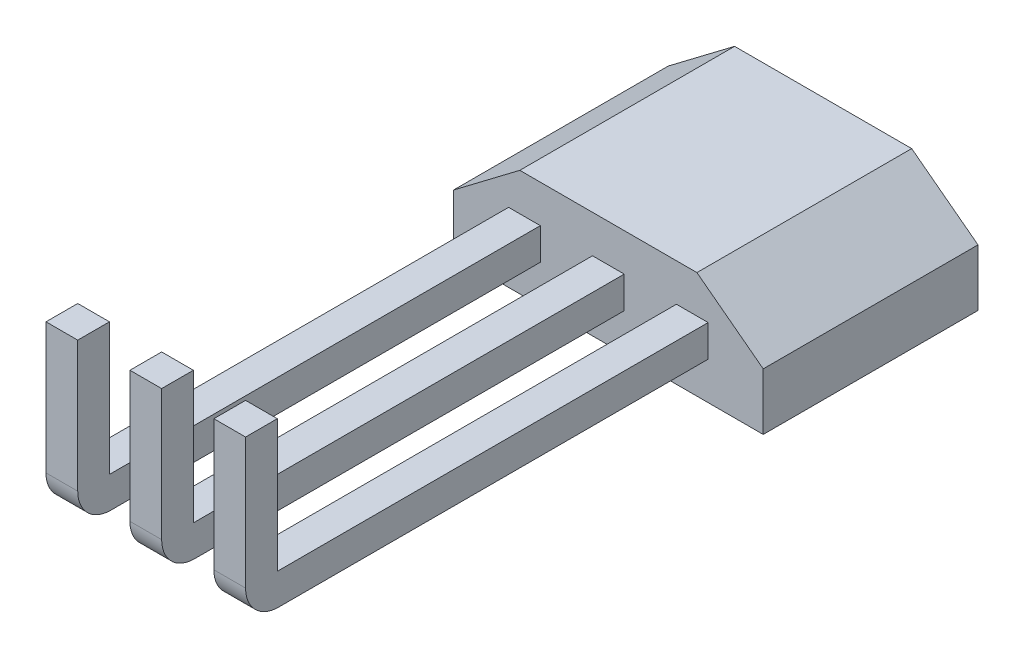
ISO-10303-21;
HEADER;
FILE_DESCRIPTION(('STEP AP214'),'2;1');
FILE_NAME('part.step','',(''),(''),'','','');
FILE_SCHEMA(('AUTOMOTIVE_DESIGN { 1 0 10303 214 1 1 1 1 }'));
ENDSEC;
DATA;
#1=APPLICATION_CONTEXT('core data for automotive mechanical design processes');
#2=APPLICATION_PROTOCOL_DEFINITION('international standard','automotive_design',2000,#1);
#3=PRODUCT_CONTEXT('',#1,'mechanical');
#4=PRODUCT('Part','Part','',(#3));
#5=PRODUCT_RELATED_PRODUCT_CATEGORY('part','',(#4));
#6=PRODUCT_DEFINITION_FORMATION('','',#4);
#7=PRODUCT_DEFINITION_CONTEXT('part definition',#1,'design');
#8=PRODUCT_DEFINITION('design','',#6,#7);
#9=PRODUCT_DEFINITION_SHAPE('','',#8);
#10=(LENGTH_UNIT() NAMED_UNIT(*) SI_UNIT(.MILLI.,.METRE.));
#11=(NAMED_UNIT(*) PLANE_ANGLE_UNIT() SI_UNIT($,.RADIAN.));
#12=(NAMED_UNIT(*) SI_UNIT($,.STERADIAN.) SOLID_ANGLE_UNIT());
#13=UNCERTAINTY_MEASURE_WITH_UNIT(LENGTH_MEASURE(1.E-05),#10,'distance_accuracy_value','');
#14=(GEOMETRIC_REPRESENTATION_CONTEXT(3) GLOBAL_UNCERTAINTY_ASSIGNED_CONTEXT((#13)) GLOBAL_UNIT_ASSIGNED_CONTEXT((#10,
#11,#12)) REPRESENTATION_CONTEXT('',''));
#15=CARTESIAN_POINT('',(0.,0.,0.));
#16=DIRECTION('',(0.,0.,1.));
#17=DIRECTION('',(1.,0.,0.));
#18=AXIS2_PLACEMENT_3D('',#15,#16,#17);
#19=CARTESIAN_POINT('',(1.03,1.05,10.25));
#20=DIRECTION('',(0.,-1.,0.));
#21=DIRECTION('',(0.,0.,-1.));
#22=AXIS2_PLACEMENT_3D('',#19,#20,#21);
#23=PLANE('',#22);
#24=DIRECTION('',(-1.,0.,0.));
#25=VECTOR('',#24,1.);
#26=CARTESIAN_POINT('',(1.03,1.05,9.77));
#27=LINE('',#26,#25);
#28=CARTESIAN_POINT('',(1.51,1.05,9.77));
#29=VERTEX_POINT('',#28);
#30=CARTESIAN_POINT('',(1.03,1.05,9.77));
#31=VERTEX_POINT('',#30);
#32=EDGE_CURVE('E247',#29,#31,#27,.T.);
#33=ORIENTED_EDGE('',*,*,#32,.F.);
#34=DIRECTION('',(0.,0.,-1.));
#35=VECTOR('',#34,1.);
#36=CARTESIAN_POINT('',(1.51,1.05,10.25));
#37=LINE('',#36,#35);
#38=CARTESIAN_POINT('',(1.51,1.05,3.25));
#39=VERTEX_POINT('',#38);
#40=EDGE_CURVE('E371',#29,#39,#37,.T.);
#41=ORIENTED_EDGE('',*,*,#40,.T.);
#42=DIRECTION('',(-1.,0.,0.));
#43=VECTOR('',#42,1.);
#44=CARTESIAN_POINT('',(1.03,1.05,3.25));
#45=LINE('',#44,#43);
#46=CARTESIAN_POINT('',(1.03,1.05,3.25));
#47=VERTEX_POINT('',#46);
#48=EDGE_CURVE('E352',#39,#47,#45,.T.);
#49=ORIENTED_EDGE('',*,*,#48,.T.);
#50=DIRECTION('',(0.,0.,-1.));
#51=VECTOR('',#50,1.);
#52=CARTESIAN_POINT('',(1.03,1.05,10.25));
#53=LINE('',#52,#51);
#54=EDGE_CURVE('E368',#31,#47,#53,.T.);
#55=ORIENTED_EDGE('',*,*,#54,.F.);
#56=EDGE_LOOP('',(#33,#41,#49,#55));
#57=FACE_BOUND('',#56,.T.);
#58=ADVANCED_FACE('F39',(#57),#23,.F.);
#59=CARTESIAN_POINT('',(-0.24,1.05,10.25));
#60=DIRECTION('',(0.,-1.,0.));
#61=DIRECTION('',(0.,0.,-1.));
#62=AXIS2_PLACEMENT_3D('',#59,#60,#61);
#63=PLANE('',#62);
#64=DIRECTION('',(-1.,0.,0.));
#65=VECTOR('',#64,1.);
#66=CARTESIAN_POINT('',(-0.24,1.05,9.77));
#67=LINE('',#66,#65);
#68=CARTESIAN_POINT('',(0.24,1.05,9.77));
#69=VERTEX_POINT('',#68);
#70=CARTESIAN_POINT('',(-0.24,1.05,9.77));
#71=VERTEX_POINT('',#70);
#72=EDGE_CURVE('E262',#69,#71,#67,.T.);
#73=ORIENTED_EDGE('',*,*,#72,.F.);
#74=DIRECTION('',(0.,0.,-1.));
#75=VECTOR('',#74,1.);
#76=CARTESIAN_POINT('',(0.24,1.05,10.25));
#77=LINE('',#76,#75);
#78=CARTESIAN_POINT('',(0.24,1.05,3.25));
#79=VERTEX_POINT('',#78);
#80=EDGE_CURVE('E406',#69,#79,#77,.T.);
#81=ORIENTED_EDGE('',*,*,#80,.T.);
#82=DIRECTION('',(-1.,0.,0.));
#83=VECTOR('',#82,1.);
#84=CARTESIAN_POINT('',(-0.24,1.05,3.25));
#85=LINE('',#84,#83);
#86=CARTESIAN_POINT('',(-0.24,1.05,3.25));
#87=VERTEX_POINT('',#86);
#88=EDGE_CURVE('E387',#79,#87,#85,.T.);
#89=ORIENTED_EDGE('',*,*,#88,.T.);
#90=DIRECTION('',(0.,0.,-1.));
#91=VECTOR('',#90,1.);
#92=CARTESIAN_POINT('',(-0.24,1.05,10.25));
#93=LINE('',#92,#91);
#94=EDGE_CURVE('E403',#71,#87,#93,.T.);
#95=ORIENTED_EDGE('',*,*,#94,.F.);
#96=EDGE_LOOP('',(#73,#81,#89,#95));
#97=FACE_BOUND('',#96,.T.);
#98=ADVANCED_FACE('F527',(#97),#63,.F.);
#99=CARTESIAN_POINT('',(-1.51,1.05,10.25));
#100=DIRECTION('',(0.,-1.,0.));
#101=DIRECTION('',(0.,0.,-1.));
#102=AXIS2_PLACEMENT_3D('',#99,#100,#101);
#103=PLANE('',#102);
#104=DIRECTION('',(-1.,0.,0.));
#105=VECTOR('',#104,1.);
#106=CARTESIAN_POINT('',(-1.51,1.05,9.77));
#107=LINE('',#106,#105);
#108=CARTESIAN_POINT('',(-1.03,1.05,9.77));
#109=VERTEX_POINT('',#108);
#110=CARTESIAN_POINT('',(-1.51,1.05,9.77));
#111=VERTEX_POINT('',#110);
#112=EDGE_CURVE('E286',#109,#111,#107,.T.);
#113=ORIENTED_EDGE('',*,*,#112,.F.);
#114=DIRECTION('',(0.,0.,-1.));
#115=VECTOR('',#114,1.);
#116=CARTESIAN_POINT('',(-1.03,1.05,10.25));
#117=LINE('',#116,#115);
#118=CARTESIAN_POINT('',(-1.03,1.05,3.25));
#119=VERTEX_POINT('',#118);
#120=EDGE_CURVE('E342',#109,#119,#117,.T.);
#121=ORIENTED_EDGE('',*,*,#120,.T.);
#122=DIRECTION('',(-1.,0.,0.));
#123=VECTOR('',#122,1.);
#124=CARTESIAN_POINT('',(-1.51,1.05,3.25));
#125=LINE('',#124,#123);
#126=CARTESIAN_POINT('',(-1.51,1.05,3.25));
#127=VERTEX_POINT('',#126);
#128=EDGE_CURVE('E323',#119,#127,#125,.T.);
#129=ORIENTED_EDGE('',*,*,#128,.T.);
#130=DIRECTION('',(0.,0.,-1.));
#131=VECTOR('',#130,1.);
#132=CARTESIAN_POINT('',(-1.51,1.05,10.25));
#133=LINE('',#132,#131);
#134=EDGE_CURVE('E339',#111,#127,#133,.T.);
#135=ORIENTED_EDGE('',*,*,#134,.F.);
#136=EDGE_LOOP('',(#113,#121,#129,#135));
#137=FACE_BOUND('',#136,.T.);
#138=ADVANCED_FACE('F533',(#137),#103,.F.);
#139=CARTESIAN_POINT('',(0.,0.,3.25));
#140=DIRECTION('',(0.,0.,-1.));
#141=DIRECTION('',(-1.,0.,0.));
#142=AXIS2_PLACEMENT_3D('',#139,#140,#141);
#143=PLANE('',#142);
#144=DIRECTION('',(0.,1.,0.));
#145=VECTOR('',#144,1.);
#146=CARTESIAN_POINT('',(1.51,1.05,3.25));
#147=LINE('',#146,#145);
#148=CARTESIAN_POINT('',(1.51,0.57,3.25));
#149=VERTEX_POINT('',#148);
#150=EDGE_CURVE('E345',#149,#39,#147,.T.);
#151=ORIENTED_EDGE('',*,*,#150,.F.);
#152=DIRECTION('',(1.,0.,0.));
#153=VECTOR('',#152,1.);
#154=CARTESIAN_POINT('',(1.03,0.57,3.25));
#155=LINE('',#154,#153);
#156=CARTESIAN_POINT('',(1.03,0.57,3.25));
#157=VERTEX_POINT('',#156);
#158=EDGE_CURVE('E347',#157,#149,#155,.T.);
#159=ORIENTED_EDGE('',*,*,#158,.F.);
#160=DIRECTION('',(0.,-1.,0.));
#161=VECTOR('',#160,1.);
#162=CARTESIAN_POINT('',(1.03,1.05,3.25));
#163=LINE('',#162,#161);
#164=EDGE_CURVE('E356',#47,#157,#163,.T.);
#165=ORIENTED_EDGE('',*,*,#164,.F.);
#166=ORIENTED_EDGE('',*,*,#48,.F.);
#167=EDGE_LOOP('',(#151,#159,#165,#166));
#168=FACE_BOUND('',#167,.T.);
#169=DIRECTION('',(0.,1.,0.));
#170=VECTOR('',#169,1.);
#171=CARTESIAN_POINT('',(2.34341667237482,0.,3.25));
#172=LINE('',#171,#170);
#173=CARTESIAN_POINT('',(2.34341667237482,0.,3.25));
#174=VERTEX_POINT('',#173);
#175=CARTESIAN_POINT('',(2.34341667237482,0.860000000000001,3.25));
#176=VERTEX_POINT('',#175);
#177=EDGE_CURVE('E410',#174,#176,#172,.T.);
#178=ORIENTED_EDGE('',*,*,#177,.T.);
#179=DIRECTION('',(-0.797154911250448,0.603774831762048,0.));
#180=VECTOR('',#179,1.);
#181=CARTESIAN_POINT('',(1.34,1.62,3.25));
#182=LINE('',#181,#180);
#183=CARTESIAN_POINT('',(1.34,1.62,3.25));
#184=VERTEX_POINT('',#183);
#185=EDGE_CURVE('E414',#176,#184,#182,.T.);
#186=ORIENTED_EDGE('',*,*,#185,.T.);
#187=DIRECTION('',(-1.,0.,0.));
#188=VECTOR('',#187,1.);
#189=CARTESIAN_POINT('',(-1.34,1.62,3.25));
#190=LINE('',#189,#188);
#191=CARTESIAN_POINT('',(-1.34,1.62,3.25));
#192=VERTEX_POINT('',#191);
#193=EDGE_CURVE('E418',#184,#192,#190,.T.);
#194=ORIENTED_EDGE('',*,*,#193,.T.);
#195=DIRECTION('',(-0.797154911250448,-0.603774831762049,0.));
#196=VECTOR('',#195,1.);
#197=CARTESIAN_POINT('',(-1.34,1.62,3.25));
#198=LINE('',#197,#196);
#199=CARTESIAN_POINT('',(-2.34341667237482,0.86,3.25));
#200=VERTEX_POINT('',#199);
#201=EDGE_CURVE('E421',#192,#200,#198,.T.);
#202=ORIENTED_EDGE('',*,*,#201,.T.);
#203=DIRECTION('',(0.,-1.,0.));
#204=VECTOR('',#203,1.);
#205=CARTESIAN_POINT('',(-2.34341667237482,0.,3.25));
#206=LINE('',#205,#204);
#207=CARTESIAN_POINT('',(-2.34341667237482,0.,3.25));
#208=VERTEX_POINT('',#207);
#209=EDGE_CURVE('E424',#200,#208,#206,.T.);
#210=ORIENTED_EDGE('',*,*,#209,.T.);
#211=DIRECTION('',(1.,0.,0.));
#212=VECTOR('',#211,1.);
#213=CARTESIAN_POINT('',(-2.34341667237482,0.,3.25));
#214=LINE('',#213,#212);
#215=EDGE_CURVE('E427',#208,#174,#214,.T.);
#216=ORIENTED_EDGE('',*,*,#215,.T.);
#217=EDGE_LOOP('',(#178,#186,#194,#202,#210,#216));
#218=FACE_BOUND('',#217,.T.);
#219=DIRECTION('',(0.,1.,0.));
#220=VECTOR('',#219,1.);
#221=CARTESIAN_POINT('',(0.24,1.05,3.25));
#222=LINE('',#221,#220);
#223=CARTESIAN_POINT('',(0.24,0.57,3.25));
#224=VERTEX_POINT('',#223);
#225=EDGE_CURVE('E374',#224,#79,#222,.T.);
#226=ORIENTED_EDGE('',*,*,#225,.F.);
#227=DIRECTION('',(1.,0.,0.));
#228=VECTOR('',#227,1.);
#229=CARTESIAN_POINT('',(-0.24,0.57,3.25));
#230=LINE('',#229,#228);
#231=CARTESIAN_POINT('',(-0.24,0.57,3.25));
#232=VERTEX_POINT('',#231);
#233=EDGE_CURVE('E379',#232,#224,#230,.T.);
#234=ORIENTED_EDGE('',*,*,#233,.F.);
#235=DIRECTION('',(0.,-1.,0.));
#236=VECTOR('',#235,1.);
#237=CARTESIAN_POINT('',(-0.24,1.05,3.25));
#238=LINE('',#237,#236);
#239=EDGE_CURVE('E391',#87,#232,#238,.T.);
#240=ORIENTED_EDGE('',*,*,#239,.F.);
#241=ORIENTED_EDGE('',*,*,#88,.F.);
#242=EDGE_LOOP('',(#226,#234,#240,#241));
#243=FACE_BOUND('',#242,.T.);
#244=DIRECTION('',(0.,1.,0.));
#245=VECTOR('',#244,1.);
#246=CARTESIAN_POINT('',(-1.03,1.05,3.25));
#247=LINE('',#246,#245);
#248=CARTESIAN_POINT('',(-1.03,0.57,3.25));
#249=VERTEX_POINT('',#248);
#250=EDGE_CURVE('E310',#249,#119,#247,.T.);
#251=ORIENTED_EDGE('',*,*,#250,.F.);
#252=DIRECTION('',(1.,0.,0.));
#253=VECTOR('',#252,1.);
#254=CARTESIAN_POINT('',(-1.51,0.57,3.25));
#255=LINE('',#254,#253);
#256=CARTESIAN_POINT('',(-1.51,0.57,3.25));
#257=VERTEX_POINT('',#256);
#258=EDGE_CURVE('E315',#257,#249,#255,.T.);
#259=ORIENTED_EDGE('',*,*,#258,.F.);
#260=DIRECTION('',(0.,-1.,0.));
#261=VECTOR('',#260,1.);
#262=CARTESIAN_POINT('',(-1.51,1.05,3.25));
#263=LINE('',#262,#261);
#264=EDGE_CURVE('E327',#127,#257,#263,.T.);
#265=ORIENTED_EDGE('',*,*,#264,.F.);
#266=ORIENTED_EDGE('',*,*,#128,.F.);
#267=EDGE_LOOP('',(#251,#259,#265,#266));
#268=FACE_BOUND('',#267,.T.);
#269=ADVANCED_FACE('F561',(#168,#218,#243,#268),#143,.F.);
#270=CARTESIAN_POINT('',(2.34341667237482,0.,3.25));
#271=DIRECTION('',(-1.,0.,0.));
#272=DIRECTION('',(0.,0.,1.));
#273=AXIS2_PLACEMENT_3D('',#270,#271,#272);
#274=PLANE('',#273);
#275=DIRECTION('',(0.,1.,0.));
#276=VECTOR('',#275,1.);
#277=CARTESIAN_POINT('',(2.34341667237482,0.,0.));
#278=LINE('',#277,#276);
#279=CARTESIAN_POINT('',(2.34341667237482,0.,0.));
#280=VERTEX_POINT('',#279);
#281=CARTESIAN_POINT('',(2.34341667237482,0.860000000000001,0.));
#282=VERTEX_POINT('',#281);
#283=EDGE_CURVE('E409',#280,#282,#278,.T.);
#284=ORIENTED_EDGE('',*,*,#283,.T.);
#285=DIRECTION('',(0.,0.,-1.));
#286=VECTOR('',#285,1.);
#287=CARTESIAN_POINT('',(2.34341667237482,0.860000000000001,3.25));
#288=LINE('',#287,#286);
#289=EDGE_CURVE('E467',#176,#282,#288,.T.);
#290=ORIENTED_EDGE('',*,*,#289,.F.);
#291=ORIENTED_EDGE('',*,*,#177,.F.);
#292=DIRECTION('',(0.,0.,-1.));
#293=VECTOR('',#292,1.);
#294=CARTESIAN_POINT('',(2.34341667237482,0.,3.25));
#295=LINE('',#294,#293);
#296=EDGE_CURVE('E430',#174,#280,#295,.T.);
#297=ORIENTED_EDGE('',*,*,#296,.T.);
#298=EDGE_LOOP('',(#284,#290,#291,#297));
#299=FACE_BOUND('',#298,.T.);
#300=ADVANCED_FACE('F564',(#299),#274,.F.);
#301=CARTESIAN_POINT('',(1.34,1.62,3.25));
#302=DIRECTION('',(-0.603774831762048,-0.797154911250448,0.));
#303=DIRECTION('',(0.797154911250449,-0.603774831762048,0.));
#304=AXIS2_PLACEMENT_3D('',#301,#302,#303);
#305=PLANE('',#304);
#306=DIRECTION('',(-0.797154911250448,0.603774831762048,0.));
#307=VECTOR('',#306,1.);
#308=CARTESIAN_POINT('',(1.34,1.62,0.));
#309=LINE('',#308,#307);
#310=CARTESIAN_POINT('',(1.34,1.62,0.));
#311=VERTEX_POINT('',#310);
#312=EDGE_CURVE('E434',#282,#311,#309,.T.);
#313=ORIENTED_EDGE('',*,*,#312,.T.);
#314=DIRECTION('',(0.,0.,-1.));
#315=VECTOR('',#314,1.);
#316=CARTESIAN_POINT('',(1.34,1.62,3.25));
#317=LINE('',#316,#315);
#318=EDGE_CURVE('E463',#184,#311,#317,.T.);
#319=ORIENTED_EDGE('',*,*,#318,.F.);
#320=ORIENTED_EDGE('',*,*,#185,.F.);
#321=ORIENTED_EDGE('',*,*,#289,.T.);
#322=EDGE_LOOP('',(#313,#319,#320,#321));
#323=FACE_BOUND('',#322,.T.);
#324=ADVANCED_FACE('F584',(#323),#305,.F.);
#325=CARTESIAN_POINT('',(-1.34,1.62,3.25));
#326=DIRECTION('',(0.,-1.,0.));
#327=DIRECTION('',(1.,0.,0.));
#328=AXIS2_PLACEMENT_3D('',#325,#326,#327);
#329=PLANE('',#328);
#330=DIRECTION('',(-1.,0.,0.));
#331=VECTOR('',#330,1.);
#332=CARTESIAN_POINT('',(-1.34,1.62,0.));
#333=LINE('',#332,#331);
#334=CARTESIAN_POINT('',(-1.34,1.62,0.));
#335=VERTEX_POINT('',#334);
#336=EDGE_CURVE('E437',#311,#335,#333,.T.);
#337=ORIENTED_EDGE('',*,*,#336,.T.);
#338=DIRECTION('',(0.,0.,-1.));
#339=VECTOR('',#338,1.);
#340=CARTESIAN_POINT('',(-1.34,1.62,3.25));
#341=LINE('',#340,#339);
#342=EDGE_CURVE('E459',#192,#335,#341,.T.);
#343=ORIENTED_EDGE('',*,*,#342,.F.);
#344=ORIENTED_EDGE('',*,*,#193,.F.);
#345=ORIENTED_EDGE('',*,*,#318,.T.);
#346=EDGE_LOOP('',(#337,#343,#344,#345));
#347=FACE_BOUND('',#346,.T.);
#348=ADVANCED_FACE('F580',(#347),#329,.F.);
#349=CARTESIAN_POINT('',(-1.34,1.62,3.25));
#350=DIRECTION('',(0.603774831762049,-0.797154911250448,0.));
#351=DIRECTION('',(0.797154911250448,0.603774831762049,0.));
#352=AXIS2_PLACEMENT_3D('',#349,#350,#351);
#353=PLANE('',#352);
#354=DIRECTION('',(-0.797154911250448,-0.603774831762049,0.));
#355=VECTOR('',#354,1.);
#356=CARTESIAN_POINT('',(-1.34,1.62,0.));
#357=LINE('',#356,#355);
#358=CARTESIAN_POINT('',(-2.34341667237482,0.86,0.));
#359=VERTEX_POINT('',#358);
#360=EDGE_CURVE('E440',#335,#359,#357,.T.);
#361=ORIENTED_EDGE('',*,*,#360,.T.);
#362=DIRECTION('',(0.,0.,-1.));
#363=VECTOR('',#362,1.);
#364=CARTESIAN_POINT('',(-2.34341667237482,0.86,3.25));
#365=LINE('',#364,#363);
#366=EDGE_CURVE('E455',#200,#359,#365,.T.);
#367=ORIENTED_EDGE('',*,*,#366,.F.);
#368=ORIENTED_EDGE('',*,*,#201,.F.);
#369=ORIENTED_EDGE('',*,*,#342,.T.);
#370=EDGE_LOOP('',(#361,#367,#368,#369));
#371=FACE_BOUND('',#370,.T.);
#372=ADVANCED_FACE('F576',(#371),#353,.F.);
#373=CARTESIAN_POINT('',(-2.34341667237482,0.,3.25));
#374=DIRECTION('',(1.,0.,0.));
#375=DIRECTION('',(0.,0.,-1.));
#376=AXIS2_PLACEMENT_3D('',#373,#374,#375);
#377=PLANE('',#376);
#378=DIRECTION('',(0.,-1.,0.));
#379=VECTOR('',#378,1.);
#380=CARTESIAN_POINT('',(-2.34341667237482,0.,0.));
#381=LINE('',#380,#379);
#382=CARTESIAN_POINT('',(-2.34341667237482,0.,0.));
#383=VERTEX_POINT('',#382);
#384=EDGE_CURVE('E443',#359,#383,#381,.T.);
#385=ORIENTED_EDGE('',*,*,#384,.T.);
#386=DIRECTION('',(0.,0.,-1.));
#387=VECTOR('',#386,1.);
#388=CARTESIAN_POINT('',(-2.34341667237482,0.,3.25));
#389=LINE('',#388,#387);
#390=EDGE_CURVE('E451',#208,#383,#389,.T.);
#391=ORIENTED_EDGE('',*,*,#390,.F.);
#392=ORIENTED_EDGE('',*,*,#209,.F.);
#393=ORIENTED_EDGE('',*,*,#366,.T.);
#394=EDGE_LOOP('',(#385,#391,#392,#393));
#395=FACE_BOUND('',#394,.T.);
#396=ADVANCED_FACE('F572',(#395),#377,.F.);
#397=CARTESIAN_POINT('',(-2.34341667237482,0.,3.25));
#398=DIRECTION('',(0.,1.,0.));
#399=DIRECTION('',(0.,0.,1.));
#400=AXIS2_PLACEMENT_3D('',#397,#398,#399);
#401=PLANE('',#400);
#402=DIRECTION('',(1.,0.,0.));
#403=VECTOR('',#402,1.);
#404=CARTESIAN_POINT('',(-2.34341667237482,0.,0.));
#405=LINE('',#404,#403);
#406=EDGE_CURVE('E415',#383,#280,#405,.T.);
#407=ORIENTED_EDGE('',*,*,#406,.T.);
#408=ORIENTED_EDGE('',*,*,#296,.F.);
#409=ORIENTED_EDGE('',*,*,#215,.F.);
#410=ORIENTED_EDGE('',*,*,#390,.T.);
#411=EDGE_LOOP('',(#407,#408,#409,#410));
#412=FACE_BOUND('',#411,.T.);
#413=ADVANCED_FACE('F568',(#412),#401,.F.);
#414=CARTESIAN_POINT('',(0.,0.,0.));
#415=DIRECTION('',(0.,0.,-1.));
#416=DIRECTION('',(-1.,0.,0.));
#417=AXIS2_PLACEMENT_3D('',#414,#415,#416);
#418=PLANE('',#417);
#419=ORIENTED_EDGE('',*,*,#283,.F.);
#420=ORIENTED_EDGE('',*,*,#406,.F.);
#421=ORIENTED_EDGE('',*,*,#384,.F.);
#422=ORIENTED_EDGE('',*,*,#360,.F.);
#423=ORIENTED_EDGE('',*,*,#336,.F.);
#424=ORIENTED_EDGE('',*,*,#312,.F.);
#425=EDGE_LOOP('',(#419,#420,#421,#422,#423,#424));
#426=FACE_BOUND('',#425,.T.);
#427=ADVANCED_FACE('F559',(#426),#418,.T.);
#428=CARTESIAN_POINT('',(0.24,1.05,10.25));
#429=DIRECTION('',(-1.,0.,0.));
#430=DIRECTION('',(0.,-1.,0.));
#431=AXIS2_PLACEMENT_3D('',#428,#429,#430);
#432=PLANE('',#431);
#433=DIRECTION('',(0.,1.,0.));
#434=VECTOR('',#433,1.);
#435=CARTESIAN_POINT('',(0.24,1.05,10.25));
#436=LINE('',#435,#434);
#437=CARTESIAN_POINT('',(0.24,1.07,10.25));
#438=VERTEX_POINT('',#437);
#439=CARTESIAN_POINT('',(0.24,3.05,10.25));
#440=VERTEX_POINT('',#439);
#441=EDGE_CURVE('E375',#438,#440,#436,.T.);
#442=ORIENTED_EDGE('',*,*,#441,.F.);
#443=CARTESIAN_POINT('',(0.24,1.07,9.75));
#444=DIRECTION('',(-1.,0.,0.));
#445=DIRECTION('',(0.,-1.,0.));
#446=AXIS2_PLACEMENT_3D('',#443,#444,#445);
#447=CIRCLE('',#446,0.5);
#448=CARTESIAN_POINT('',(0.24,0.57,9.75));
#449=VERTEX_POINT('',#448);
#450=EDGE_CURVE('E486',#438,#449,#447,.F.);
#451=ORIENTED_EDGE('',*,*,#450,.T.);
#452=DIRECTION('',(0.,0.,-1.));
#453=VECTOR('',#452,1.);
#454=CARTESIAN_POINT('',(0.24,0.57,10.25));
#455=LINE('',#454,#453);
#456=EDGE_CURVE('E383',#449,#224,#455,.T.);
#457=ORIENTED_EDGE('',*,*,#456,.T.);
#458=ORIENTED_EDGE('',*,*,#225,.T.);
#459=ORIENTED_EDGE('',*,*,#80,.F.);
#460=DIRECTION('',(0.,-1.,0.));
#461=VECTOR('',#460,1.);
#462=CARTESIAN_POINT('',(0.24,3.05,9.77));
#463=LINE('',#462,#461);
#464=CARTESIAN_POINT('',(0.24,3.05,9.77));
#465=VERTEX_POINT('',#464);
#466=EDGE_CURVE('E283',#465,#69,#463,.T.);
#467=ORIENTED_EDGE('',*,*,#466,.F.);
#468=DIRECTION('',(0.,0.,-1.));
#469=VECTOR('',#468,1.);
#470=CARTESIAN_POINT('',(0.24,3.05,10.25));
#471=LINE('',#470,#469);
#472=EDGE_CURVE('E271',#440,#465,#471,.T.);
#473=ORIENTED_EDGE('',*,*,#472,.F.);
#474=EDGE_LOOP('',(#442,#451,#457,#458,#459,#467,#473));
#475=FACE_BOUND('',#474,.T.);
#476=ADVANCED_FACE('F554',(#475),#432,.F.);
#477=CARTESIAN_POINT('',(-0.24,1.05,10.25));
#478=DIRECTION('',(1.,0.,0.));
#479=DIRECTION('',(0.,1.,0.));
#480=AXIS2_PLACEMENT_3D('',#477,#478,#479);
#481=PLANE('',#480);
#482=DIRECTION('',(0.,0.,-1.));
#483=VECTOR('',#482,1.);
#484=CARTESIAN_POINT('',(-0.24,0.57,10.25));
#485=LINE('',#484,#483);
#486=CARTESIAN_POINT('',(-0.24,0.57,9.75));
#487=VERTEX_POINT('',#486);
#488=EDGE_CURVE('E400',#487,#232,#485,.T.);
#489=ORIENTED_EDGE('',*,*,#488,.F.);
#490=CARTESIAN_POINT('',(-0.24,1.07,9.75));
#491=DIRECTION('',(1.,0.,0.));
#492=DIRECTION('',(0.,1.,0.));
#493=AXIS2_PLACEMENT_3D('',#490,#491,#492);
#494=CIRCLE('',#493,0.5);
#495=CARTESIAN_POINT('',(-0.24,1.07,10.25));
#496=VERTEX_POINT('',#495);
#497=EDGE_CURVE('E492',#487,#496,#494,.F.);
#498=ORIENTED_EDGE('',*,*,#497,.T.);
#499=DIRECTION('',(0.,-1.,0.));
#500=VECTOR('',#499,1.);
#501=CARTESIAN_POINT('',(-0.24,1.05,10.25));
#502=LINE('',#501,#500);
#503=CARTESIAN_POINT('',(-0.24,3.05,10.25));
#504=VERTEX_POINT('',#503);
#505=EDGE_CURVE('E378',#504,#496,#502,.T.);
#506=ORIENTED_EDGE('',*,*,#505,.F.);
#507=DIRECTION('',(0.,0.,1.));
#508=VECTOR('',#507,1.);
#509=CARTESIAN_POINT('',(-0.24,3.05,10.25));
#510=LINE('',#509,#508);
#511=CARTESIAN_POINT('',(-0.24,3.05,9.77));
#512=VERTEX_POINT('',#511);
#513=EDGE_CURVE('E263',#512,#504,#510,.T.);
#514=ORIENTED_EDGE('',*,*,#513,.F.);
#515=DIRECTION('',(0.,-1.,0.));
#516=VECTOR('',#515,1.);
#517=CARTESIAN_POINT('',(-0.24,3.05,9.77));
#518=LINE('',#517,#516);
#519=EDGE_CURVE('E277',#512,#71,#518,.T.);
#520=ORIENTED_EDGE('',*,*,#519,.T.);
#521=ORIENTED_EDGE('',*,*,#94,.T.);
#522=ORIENTED_EDGE('',*,*,#239,.T.);
#523=EDGE_LOOP('',(#489,#498,#506,#514,#520,#521,#522));
#524=FACE_BOUND('',#523,.T.);
#525=ADVANCED_FACE('F551',(#524),#481,.F.);
#526=CARTESIAN_POINT('',(-0.24,0.57,10.25));
#527=DIRECTION('',(0.,1.,0.));
#528=DIRECTION('',(0.,0.,1.));
#529=AXIS2_PLACEMENT_3D('',#526,#527,#528);
#530=PLANE('',#529);
#531=ORIENTED_EDGE('',*,*,#456,.F.);
#532=DIRECTION('',(1.,0.,0.));
#533=VECTOR('',#532,1.);
#534=CARTESIAN_POINT('',(-0.24,0.57,9.75));
#535=LINE('',#534,#533);
#536=EDGE_CURVE('E489',#449,#487,#535,.F.);
#537=ORIENTED_EDGE('',*,*,#536,.T.);
#538=ORIENTED_EDGE('',*,*,#488,.T.);
#539=ORIENTED_EDGE('',*,*,#233,.T.);
#540=EDGE_LOOP('',(#531,#537,#538,#539));
#541=FACE_BOUND('',#540,.T.);
#542=ADVANCED_FACE('F547',(#541),#530,.F.);
#543=CARTESIAN_POINT('',(0.,0.,10.25));
#544=DIRECTION('',(0.,0.,1.));
#545=DIRECTION('',(1.,0.,0.));
#546=AXIS2_PLACEMENT_3D('',#543,#544,#545);
#547=PLANE('',#546);
#548=ORIENTED_EDGE('',*,*,#505,.T.);
#549=DIRECTION('',(1.,0.,0.));
#550=VECTOR('',#549,1.);
#551=CARTESIAN_POINT('',(0.24,1.07,10.25));
#552=LINE('',#551,#550);
#553=EDGE_CURVE('E482',#496,#438,#552,.T.);
#554=ORIENTED_EDGE('',*,*,#553,.T.);
#555=ORIENTED_EDGE('',*,*,#441,.T.);
#556=DIRECTION('',(1.,0.,0.));
#557=VECTOR('',#556,1.);
#558=CARTESIAN_POINT('',(-0.24,3.05,10.25));
#559=LINE('',#558,#557);
#560=EDGE_CURVE('E267',#504,#440,#559,.T.);
#561=ORIENTED_EDGE('',*,*,#560,.F.);
#562=EDGE_LOOP('',(#548,#554,#555,#561));
#563=FACE_BOUND('',#562,.T.);
#564=ADVANCED_FACE('F543',(#563),#547,.T.);
#565=CARTESIAN_POINT('',(1.51,1.05,10.25));
#566=DIRECTION('',(-1.,0.,0.));
#567=DIRECTION('',(0.,0.,1.));
#568=AXIS2_PLACEMENT_3D('',#565,#566,#567);
#569=PLANE('',#568);
#570=DIRECTION('',(0.,1.,0.));
#571=VECTOR('',#570,1.);
#572=CARTESIAN_POINT('',(1.51,1.05,10.25));
#573=LINE('',#572,#571);
#574=CARTESIAN_POINT('',(1.51,1.07,10.25));
#575=VERTEX_POINT('',#574);
#576=CARTESIAN_POINT('',(1.51,3.05,10.25));
#577=VERTEX_POINT('',#576);
#578=EDGE_CURVE('E231',#575,#577,#573,.T.);
#579=ORIENTED_EDGE('',*,*,#578,.F.);
#580=CARTESIAN_POINT('',(1.51,1.07,9.75));
#581=DIRECTION('',(-1.,0.,0.));
#582=DIRECTION('',(0.,0.,1.));
#583=AXIS2_PLACEMENT_3D('',#580,#581,#582);
#584=CIRCLE('',#583,0.5);
#585=CARTESIAN_POINT('',(1.51,0.57,9.75));
#586=VERTEX_POINT('',#585);
#587=EDGE_CURVE('E474',#575,#586,#584,.F.);
#588=ORIENTED_EDGE('',*,*,#587,.T.);
#589=DIRECTION('',(0.,0.,-1.));
#590=VECTOR('',#589,1.);
#591=CARTESIAN_POINT('',(1.51,0.57,10.25));
#592=LINE('',#591,#590);
#593=EDGE_CURVE('E230',#586,#149,#592,.T.);
#594=ORIENTED_EDGE('',*,*,#593,.T.);
#595=ORIENTED_EDGE('',*,*,#150,.T.);
#596=ORIENTED_EDGE('',*,*,#40,.F.);
#597=DIRECTION('',(0.,-1.,0.));
#598=VECTOR('',#597,1.);
#599=CARTESIAN_POINT('',(1.51,3.05,9.77));
#600=LINE('',#599,#598);
#601=CARTESIAN_POINT('',(1.51,3.05,9.77));
#602=VERTEX_POINT('',#601);
#603=EDGE_CURVE('E259',#602,#29,#600,.T.);
#604=ORIENTED_EDGE('',*,*,#603,.F.);
#605=DIRECTION('',(0.,0.,-1.));
#606=VECTOR('',#605,1.);
#607=CARTESIAN_POINT('',(1.51,3.05,10.25));
#608=LINE('',#607,#606);
#609=EDGE_CURVE('E240',#577,#602,#608,.T.);
#610=ORIENTED_EDGE('',*,*,#609,.F.);
#611=EDGE_LOOP('',(#579,#588,#594,#595,#596,#604,#610));
#612=FACE_BOUND('',#611,.T.);
#613=ADVANCED_FACE('F540',(#612),#569,.F.);
#614=CARTESIAN_POINT('',(1.03,1.05,10.25));
#615=DIRECTION('',(1.,0.,0.));
#616=DIRECTION('',(0.,0.,-1.));
#617=AXIS2_PLACEMENT_3D('',#614,#615,#616);
#618=PLANE('',#617);
#619=DIRECTION('',(0.,0.,-1.));
#620=VECTOR('',#619,1.);
#621=CARTESIAN_POINT('',(1.03,0.57,10.25));
#622=LINE('',#621,#620);
#623=CARTESIAN_POINT('',(1.03,0.57,9.75));
#624=VERTEX_POINT('',#623);
#625=EDGE_CURVE('E365',#624,#157,#622,.T.);
#626=ORIENTED_EDGE('',*,*,#625,.F.);
#627=CARTESIAN_POINT('',(1.03,1.07,9.75));
#628=DIRECTION('',(1.,0.,0.));
#629=DIRECTION('',(0.,0.,-1.));
#630=AXIS2_PLACEMENT_3D('',#627,#628,#629);
#631=CIRCLE('',#630,0.5);
#632=CARTESIAN_POINT('',(1.03,1.07,10.25));
#633=VERTEX_POINT('',#632);
#634=EDGE_CURVE('E225',#624,#633,#631,.F.);
#635=ORIENTED_EDGE('',*,*,#634,.T.);
#636=DIRECTION('',(0.,-1.,0.));
#637=VECTOR('',#636,1.);
#638=CARTESIAN_POINT('',(1.03,1.05,10.25));
#639=LINE('',#638,#637);
#640=CARTESIAN_POINT('',(1.03,3.05,10.25));
#641=VERTEX_POINT('',#640);
#642=EDGE_CURVE('E217',#641,#633,#639,.T.);
#643=ORIENTED_EDGE('',*,*,#642,.F.);
#644=DIRECTION('',(0.,0.,1.));
#645=VECTOR('',#644,1.);
#646=CARTESIAN_POINT('',(1.03,3.05,10.25));
#647=LINE('',#646,#645);
#648=CARTESIAN_POINT('',(1.03,3.05,9.77));
#649=VERTEX_POINT('',#648);
#650=EDGE_CURVE('E223',#649,#641,#647,.T.);
#651=ORIENTED_EDGE('',*,*,#650,.F.);
#652=DIRECTION('',(0.,-1.,0.));
#653=VECTOR('',#652,1.);
#654=CARTESIAN_POINT('',(1.03,3.05,9.77));
#655=LINE('',#654,#653);
#656=EDGE_CURVE('E255',#649,#31,#655,.T.);
#657=ORIENTED_EDGE('',*,*,#656,.T.);
#658=ORIENTED_EDGE('',*,*,#54,.T.);
#659=ORIENTED_EDGE('',*,*,#164,.T.);
#660=EDGE_LOOP('',(#626,#635,#643,#651,#657,#658,#659));
#661=FACE_BOUND('',#660,.T.);
#662=ADVANCED_FACE('F220',(#661),#618,.F.);
#663=CARTESIAN_POINT('',(1.03,0.57,10.25));
#664=DIRECTION('',(0.,1.,0.));
#665=DIRECTION('',(0.,0.,1.));
#666=AXIS2_PLACEMENT_3D('',#663,#664,#665);
#667=PLANE('',#666);
#668=ORIENTED_EDGE('',*,*,#593,.F.);
#669=DIRECTION('',(1.,0.,0.));
#670=VECTOR('',#669,1.);
#671=CARTESIAN_POINT('',(1.03,0.57,9.75));
#672=LINE('',#671,#670);
#673=EDGE_CURVE('E477',#586,#624,#672,.F.);
#674=ORIENTED_EDGE('',*,*,#673,.T.);
#675=ORIENTED_EDGE('',*,*,#625,.T.);
#676=ORIENTED_EDGE('',*,*,#158,.T.);
#677=EDGE_LOOP('',(#668,#674,#675,#676));
#678=FACE_BOUND('',#677,.T.);
#679=ADVANCED_FACE('F611',(#678),#667,.F.);
#680=CARTESIAN_POINT('',(0.,0.,10.25));
#681=DIRECTION('',(0.,0.,1.));
#682=DIRECTION('',(1.,0.,0.));
#683=AXIS2_PLACEMENT_3D('',#680,#681,#682);
#684=PLANE('',#683);
#685=ORIENTED_EDGE('',*,*,#642,.T.);
#686=DIRECTION('',(1.,0.,0.));
#687=VECTOR('',#686,1.);
#688=CARTESIAN_POINT('',(1.51,1.07,10.25));
#689=LINE('',#688,#687);
#690=EDGE_CURVE('E471',#633,#575,#689,.T.);
#691=ORIENTED_EDGE('',*,*,#690,.T.);
#692=ORIENTED_EDGE('',*,*,#578,.T.);
#693=DIRECTION('',(1.,0.,0.));
#694=VECTOR('',#693,1.);
#695=CARTESIAN_POINT('',(1.03,3.05,10.25));
#696=LINE('',#695,#694);
#697=EDGE_CURVE('E234',#641,#577,#696,.T.);
#698=ORIENTED_EDGE('',*,*,#697,.F.);
#699=EDGE_LOOP('',(#685,#691,#692,#698));
#700=FACE_BOUND('',#699,.T.);
#701=ADVANCED_FACE('F235',(#700),#684,.T.);
#702=CARTESIAN_POINT('',(-1.03,1.05,10.25));
#703=DIRECTION('',(-1.,0.,0.));
#704=DIRECTION('',(0.,0.,1.));
#705=AXIS2_PLACEMENT_3D('',#702,#703,#704);
#706=PLANE('',#705);
#707=DIRECTION('',(0.,1.,0.));
#708=VECTOR('',#707,1.);
#709=CARTESIAN_POINT('',(-1.03,1.05,10.25));
#710=LINE('',#709,#708);
#711=CARTESIAN_POINT('',(-1.03,1.07,10.25));
#712=VERTEX_POINT('',#711);
#713=CARTESIAN_POINT('',(-1.03,3.05,10.25));
#714=VERTEX_POINT('',#713);
#715=EDGE_CURVE('E311',#712,#714,#710,.T.);
#716=ORIENTED_EDGE('',*,*,#715,.F.);
#717=CARTESIAN_POINT('',(-1.03,1.07,9.75));
#718=DIRECTION('',(-1.,0.,0.));
#719=DIRECTION('',(0.,0.,1.));
#720=AXIS2_PLACEMENT_3D('',#717,#718,#719);
#721=CIRCLE('',#720,0.5);
#722=CARTESIAN_POINT('',(-1.03,0.57,9.75));
#723=VERTEX_POINT('',#722);
#724=EDGE_CURVE('E62',#712,#723,#721,.F.);
#725=ORIENTED_EDGE('',*,*,#724,.T.);
#726=DIRECTION('',(0.,0.,-1.));
#727=VECTOR('',#726,1.);
#728=CARTESIAN_POINT('',(-1.03,0.57,10.25));
#729=LINE('',#728,#727);
#730=EDGE_CURVE('E319',#723,#249,#729,.T.);
#731=ORIENTED_EDGE('',*,*,#730,.T.);
#732=ORIENTED_EDGE('',*,*,#250,.T.);
#733=ORIENTED_EDGE('',*,*,#120,.F.);
#734=DIRECTION('',(0.,-1.,0.));
#735=VECTOR('',#734,1.);
#736=CARTESIAN_POINT('',(-1.03,3.05,9.77));
#737=LINE('',#736,#735);
#738=CARTESIAN_POINT('',(-1.03,3.05,9.77));
#739=VERTEX_POINT('',#738);
#740=EDGE_CURVE('E307',#739,#109,#737,.T.);
#741=ORIENTED_EDGE('',*,*,#740,.F.);
#742=DIRECTION('',(0.,0.,-1.));
#743=VECTOR('',#742,1.);
#744=CARTESIAN_POINT('',(-1.03,3.05,10.25));
#745=LINE('',#744,#743);
#746=EDGE_CURVE('E295',#714,#739,#745,.T.);
#747=ORIENTED_EDGE('',*,*,#746,.F.);
#748=EDGE_LOOP('',(#716,#725,#731,#732,#733,#741,#747));
#749=FACE_BOUND('',#748,.T.);
#750=ADVANCED_FACE('F508',(#749),#706,.F.);
#751=CARTESIAN_POINT('',(-1.51,1.05,10.25));
#752=DIRECTION('',(1.,0.,0.));
#753=DIRECTION('',(0.,0.,-1.));
#754=AXIS2_PLACEMENT_3D('',#751,#752,#753);
#755=PLANE('',#754);
#756=DIRECTION('',(0.,0.,-1.));
#757=VECTOR('',#756,1.);
#758=CARTESIAN_POINT('',(-1.51,0.57,10.25));
#759=LINE('',#758,#757);
#760=CARTESIAN_POINT('',(-1.51,0.57,9.75));
#761=VERTEX_POINT('',#760);
#762=EDGE_CURVE('E336',#761,#257,#759,.T.);
#763=ORIENTED_EDGE('',*,*,#762,.F.);
#764=CARTESIAN_POINT('',(-1.51,1.07,9.75));
#765=DIRECTION('',(1.,0.,0.));
#766=DIRECTION('',(0.,0.,-1.));
#767=AXIS2_PLACEMENT_3D('',#764,#765,#766);
#768=CIRCLE('',#767,0.5);
#769=CARTESIAN_POINT('',(-1.51,1.07,10.25));
#770=VERTEX_POINT('',#769);
#771=EDGE_CURVE('E11',#761,#770,#768,.F.);
#772=ORIENTED_EDGE('',*,*,#771,.T.);
#773=DIRECTION('',(0.,-1.,0.));
#774=VECTOR('',#773,1.);
#775=CARTESIAN_POINT('',(-1.51,1.05,10.25));
#776=LINE('',#775,#774);
#777=CARTESIAN_POINT('',(-1.51,3.05,10.25));
#778=VERTEX_POINT('',#777);
#779=EDGE_CURVE('E314',#778,#770,#776,.T.);
#780=ORIENTED_EDGE('',*,*,#779,.F.);
#781=DIRECTION('',(0.,0.,1.));
#782=VECTOR('',#781,1.);
#783=CARTESIAN_POINT('',(-1.51,3.05,10.25));
#784=LINE('',#783,#782);
#785=CARTESIAN_POINT('',(-1.51,3.05,9.77));
#786=VERTEX_POINT('',#785);
#787=EDGE_CURVE('E287',#786,#778,#784,.T.);
#788=ORIENTED_EDGE('',*,*,#787,.F.);
#789=DIRECTION('',(0.,-1.,0.));
#790=VECTOR('',#789,1.);
#791=CARTESIAN_POINT('',(-1.51,3.05,9.77));
#792=LINE('',#791,#790);
#793=EDGE_CURVE('E301',#786,#111,#792,.T.);
#794=ORIENTED_EDGE('',*,*,#793,.T.);
#795=ORIENTED_EDGE('',*,*,#134,.T.);
#796=ORIENTED_EDGE('',*,*,#264,.T.);
#797=EDGE_LOOP('',(#763,#772,#780,#788,#794,#795,#796));
#798=FACE_BOUND('',#797,.T.);
#799=ADVANCED_FACE('F517',(#798),#755,.F.);
#800=CARTESIAN_POINT('',(-1.51,0.57,10.25));
#801=DIRECTION('',(0.,1.,0.));
#802=DIRECTION('',(0.,0.,1.));
#803=AXIS2_PLACEMENT_3D('',#800,#801,#802);
#804=PLANE('',#803);
#805=ORIENTED_EDGE('',*,*,#730,.F.);
#806=DIRECTION('',(1.,0.,0.));
#807=VECTOR('',#806,1.);
#808=CARTESIAN_POINT('',(-1.51,0.57,9.75));
#809=LINE('',#808,#807);
#810=EDGE_CURVE('E48',#723,#761,#809,.F.);
#811=ORIENTED_EDGE('',*,*,#810,.T.);
#812=ORIENTED_EDGE('',*,*,#762,.T.);
#813=ORIENTED_EDGE('',*,*,#258,.T.);
#814=EDGE_LOOP('',(#805,#811,#812,#813));
#815=FACE_BOUND('',#814,.T.);
#816=ADVANCED_FACE('F626',(#815),#804,.F.);
#817=CARTESIAN_POINT('',(0.,0.,10.25));
#818=DIRECTION('',(0.,0.,1.));
#819=DIRECTION('',(1.,0.,0.));
#820=AXIS2_PLACEMENT_3D('',#817,#818,#819);
#821=PLANE('',#820);
#822=ORIENTED_EDGE('',*,*,#779,.T.);
#823=DIRECTION('',(1.,0.,0.));
#824=VECTOR('',#823,1.);
#825=CARTESIAN_POINT('',(-1.03,1.07,10.25));
#826=LINE('',#825,#824);
#827=EDGE_CURVE('E495',#770,#712,#826,.T.);
#828=ORIENTED_EDGE('',*,*,#827,.T.);
#829=ORIENTED_EDGE('',*,*,#715,.T.);
#830=DIRECTION('',(1.,0.,0.));
#831=VECTOR('',#830,1.);
#832=CARTESIAN_POINT('',(-1.51,3.05,10.25));
#833=LINE('',#832,#831);
#834=EDGE_CURVE('E291',#778,#714,#833,.T.);
#835=ORIENTED_EDGE('',*,*,#834,.F.);
#836=EDGE_LOOP('',(#822,#828,#829,#835));
#837=FACE_BOUND('',#836,.T.);
#838=ADVANCED_FACE('F503',(#837),#821,.T.);
#839=CARTESIAN_POINT('',(-1.51,3.05,9.77));
#840=DIRECTION('',(0.,0.,1.));
#841=DIRECTION('',(1.,0.,0.));
#842=AXIS2_PLACEMENT_3D('',#839,#840,#841);
#843=PLANE('',#842);
#844=ORIENTED_EDGE('',*,*,#112,.T.);
#845=ORIENTED_EDGE('',*,*,#793,.F.);
#846=DIRECTION('',(-1.,0.,0.));
#847=VECTOR('',#846,1.);
#848=CARTESIAN_POINT('',(-1.51,3.05,9.77));
#849=LINE('',#848,#847);
#850=EDGE_CURVE('E298',#739,#786,#849,.T.);
#851=ORIENTED_EDGE('',*,*,#850,.F.);
#852=ORIENTED_EDGE('',*,*,#740,.T.);
#853=EDGE_LOOP('',(#844,#845,#851,#852));
#854=FACE_BOUND('',#853,.T.);
#855=ADVANCED_FACE('F631',(#854),#843,.F.);
#856=CARTESIAN_POINT('',(0.,3.05,0.));
#857=DIRECTION('',(0.,-1.,0.));
#858=DIRECTION('',(0.,0.,-1.));
#859=AXIS2_PLACEMENT_3D('',#856,#857,#858);
#860=PLANE('',#859);
#861=ORIENTED_EDGE('',*,*,#787,.T.);
#862=ORIENTED_EDGE('',*,*,#834,.T.);
#863=ORIENTED_EDGE('',*,*,#746,.T.);
#864=ORIENTED_EDGE('',*,*,#850,.T.);
#865=EDGE_LOOP('',(#861,#862,#863,#864));
#866=FACE_BOUND('',#865,.T.);
#867=ADVANCED_FACE('F513',(#866),#860,.F.);
#868=CARTESIAN_POINT('',(-0.24,3.05,9.77));
#869=DIRECTION('',(0.,0.,1.));
#870=DIRECTION('',(1.,0.,0.));
#871=AXIS2_PLACEMENT_3D('',#868,#869,#870);
#872=PLANE('',#871);
#873=ORIENTED_EDGE('',*,*,#72,.T.);
#874=ORIENTED_EDGE('',*,*,#519,.F.);
#875=DIRECTION('',(-1.,0.,0.));
#876=VECTOR('',#875,1.);
#877=CARTESIAN_POINT('',(-0.24,3.05,9.77));
#878=LINE('',#877,#876);
#879=EDGE_CURVE('E274',#465,#512,#878,.T.);
#880=ORIENTED_EDGE('',*,*,#879,.F.);
#881=ORIENTED_EDGE('',*,*,#466,.T.);
#882=EDGE_LOOP('',(#873,#874,#880,#881));
#883=FACE_BOUND('',#882,.T.);
#884=ADVANCED_FACE('F637',(#883),#872,.F.);
#885=CARTESIAN_POINT('',(0.,3.05,0.));
#886=DIRECTION('',(0.,-1.,0.));
#887=DIRECTION('',(0.,0.,-1.));
#888=AXIS2_PLACEMENT_3D('',#885,#886,#887);
#889=PLANE('',#888);
#890=ORIENTED_EDGE('',*,*,#513,.T.);
#891=ORIENTED_EDGE('',*,*,#560,.T.);
#892=ORIENTED_EDGE('',*,*,#472,.T.);
#893=ORIENTED_EDGE('',*,*,#879,.T.);
#894=EDGE_LOOP('',(#890,#891,#892,#893));
#895=FACE_BOUND('',#894,.T.);
#896=ADVANCED_FACE('F640',(#895),#889,.F.);
#897=CARTESIAN_POINT('',(1.03,3.05,9.77));
#898=DIRECTION('',(0.,0.,1.));
#899=DIRECTION('',(1.,0.,0.));
#900=AXIS2_PLACEMENT_3D('',#897,#898,#899);
#901=PLANE('',#900);
#902=ORIENTED_EDGE('',*,*,#32,.T.);
#903=ORIENTED_EDGE('',*,*,#656,.F.);
#904=DIRECTION('',(-1.,0.,0.));
#905=VECTOR('',#904,1.);
#906=CARTESIAN_POINT('',(1.03,3.05,9.77));
#907=LINE('',#906,#905);
#908=EDGE_CURVE('E244',#602,#649,#907,.T.);
#909=ORIENTED_EDGE('',*,*,#908,.F.);
#910=ORIENTED_EDGE('',*,*,#603,.T.);
#911=EDGE_LOOP('',(#902,#903,#909,#910));
#912=FACE_BOUND('',#911,.T.);
#913=ADVANCED_FACE('F597',(#912),#901,.F.);
#914=CARTESIAN_POINT('',(0.,3.05,0.));
#915=DIRECTION('',(0.,-1.,0.));
#916=DIRECTION('',(0.,0.,-1.));
#917=AXIS2_PLACEMENT_3D('',#914,#915,#916);
#918=PLANE('',#917);
#919=ORIENTED_EDGE('',*,*,#650,.T.);
#920=ORIENTED_EDGE('',*,*,#697,.T.);
#921=ORIENTED_EDGE('',*,*,#609,.T.);
#922=ORIENTED_EDGE('',*,*,#908,.T.);
#923=EDGE_LOOP('',(#919,#920,#921,#922));
#924=FACE_BOUND('',#923,.T.);
#925=ADVANCED_FACE('F242',(#924),#918,.F.);
#926=CARTESIAN_POINT('',(0.,1.07,9.75));
#927=DIRECTION('',(-1.,0.,0.));
#928=DIRECTION('',(0.,0.,1.));
#929=AXIS2_PLACEMENT_3D('',#926,#927,#928);
#930=CYLINDRICAL_SURFACE('',#929,0.5);
#931=ORIENTED_EDGE('',*,*,#634,.F.);
#932=ORIENTED_EDGE('',*,*,#673,.F.);
#933=ORIENTED_EDGE('',*,*,#587,.F.);
#934=ORIENTED_EDGE('',*,*,#690,.F.);
#935=EDGE_LOOP('',(#931,#932,#933,#934));
#936=FACE_BOUND('',#935,.T.);
#937=ADVANCED_FACE('F524',(#936),#930,.T.);
#938=CARTESIAN_POINT('',(0.,1.07,9.75));
#939=DIRECTION('',(-1.,0.,0.));
#940=DIRECTION('',(0.,0.,1.));
#941=AXIS2_PLACEMENT_3D('',#938,#939,#940);
#942=CYLINDRICAL_SURFACE('',#941,0.5);
#943=ORIENTED_EDGE('',*,*,#497,.F.);
#944=ORIENTED_EDGE('',*,*,#536,.F.);
#945=ORIENTED_EDGE('',*,*,#450,.F.);
#946=ORIENTED_EDGE('',*,*,#553,.F.);
#947=EDGE_LOOP('',(#943,#944,#945,#946));
#948=FACE_BOUND('',#947,.T.);
#949=ADVANCED_FACE('F520',(#948),#942,.T.);
#950=CARTESIAN_POINT('',(0.,1.07,9.75));
#951=DIRECTION('',(-1.,0.,0.));
#952=DIRECTION('',(0.,0.,1.));
#953=AXIS2_PLACEMENT_3D('',#950,#951,#952);
#954=CYLINDRICAL_SURFACE('',#953,0.5);
#955=ORIENTED_EDGE('',*,*,#771,.F.);
#956=ORIENTED_EDGE('',*,*,#810,.F.);
#957=ORIENTED_EDGE('',*,*,#724,.F.);
#958=ORIENTED_EDGE('',*,*,#827,.F.);
#959=EDGE_LOOP('',(#955,#956,#957,#958));
#960=FACE_BOUND('',#959,.T.);
#961=ADVANCED_FACE('F41',(#960),#954,.T.);
#962=CLOSED_SHELL('',(#58,#98,#138,#269,#300,#324,#348,#372,#396,#413,#427,#476,#525,#542,#564,
#613,#662,#679,#701,#750,#799,#816,#838,#855,#867,#884,#896,#913,#925,#937,#949,#961));
#963=MANIFOLD_SOLID_BREP('B2',#962);
#964=ADVANCED_BREP_SHAPE_REPRESENTATION('',(#18,#963),#14);
#965=SHAPE_DEFINITION_REPRESENTATION(#9,#964);
ENDSEC;
END-ISO-10303-21;
